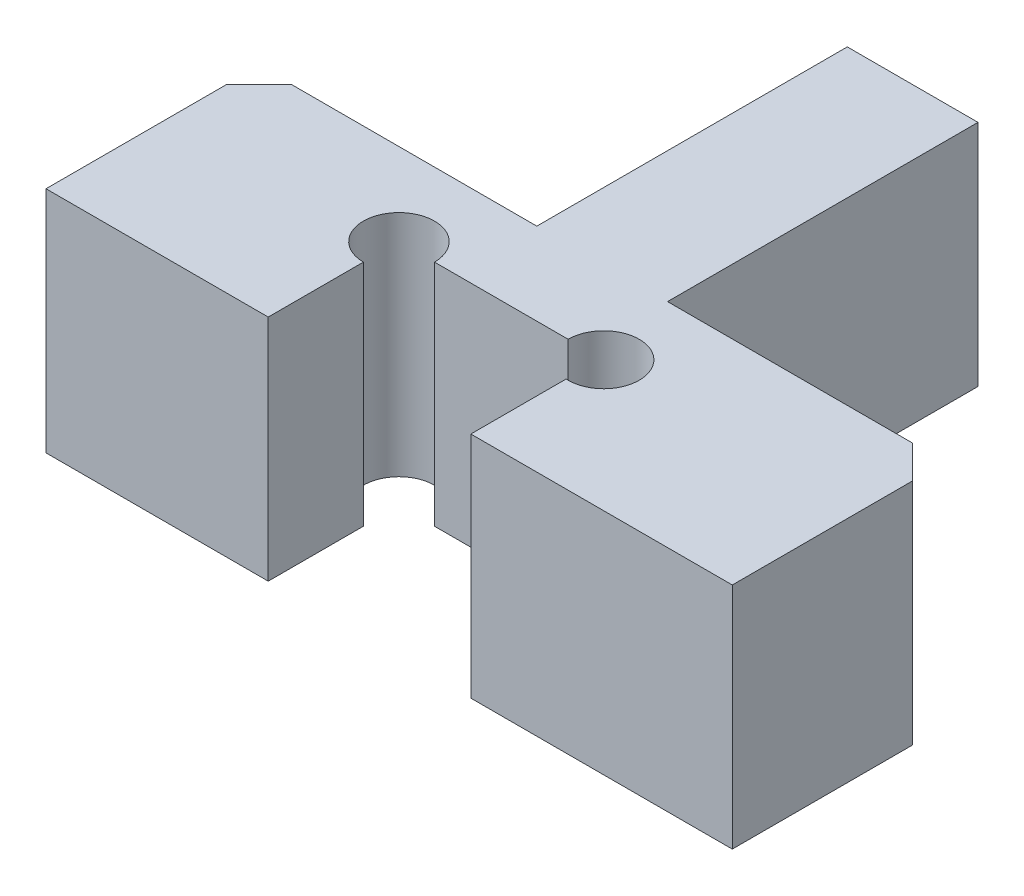
ISO-10303-21;
HEADER;
FILE_DESCRIPTION(('STEP AP214'),'2;1');
FILE_NAME('part.step','',(''),(''),'','','');
FILE_SCHEMA(('AUTOMOTIVE_DESIGN { 1 0 10303 214 1 1 1 1 }'));
ENDSEC;
DATA;
#1=APPLICATION_CONTEXT('core data for automotive mechanical design processes');
#2=APPLICATION_PROTOCOL_DEFINITION('international standard','automotive_design',2000,#1);
#3=PRODUCT_CONTEXT('',#1,'mechanical');
#4=PRODUCT('Part','Part','',(#3));
#5=PRODUCT_RELATED_PRODUCT_CATEGORY('part','',(#4));
#6=PRODUCT_DEFINITION_FORMATION('','',#4);
#7=PRODUCT_DEFINITION_CONTEXT('part definition',#1,'design');
#8=PRODUCT_DEFINITION('design','',#6,#7);
#9=PRODUCT_DEFINITION_SHAPE('','',#8);
#10=(LENGTH_UNIT() NAMED_UNIT(*) SI_UNIT(.MILLI.,.METRE.));
#11=(NAMED_UNIT(*) PLANE_ANGLE_UNIT() SI_UNIT($,.RADIAN.));
#12=(NAMED_UNIT(*) SI_UNIT($,.STERADIAN.) SOLID_ANGLE_UNIT());
#13=UNCERTAINTY_MEASURE_WITH_UNIT(LENGTH_MEASURE(1.E-05),#10,'distance_accuracy_value','');
#14=(GEOMETRIC_REPRESENTATION_CONTEXT(3) GLOBAL_UNCERTAINTY_ASSIGNED_CONTEXT((#13)) GLOBAL_UNIT_ASSIGNED_CONTEXT((#10,
#11,#12)) REPRESENTATION_CONTEXT('',''));
#15=CARTESIAN_POINT('',(0.,0.,0.));
#16=DIRECTION('',(0.,0.,1.));
#17=DIRECTION('',(1.,0.,0.));
#18=AXIS2_PLACEMENT_3D('',#15,#16,#17);
#19=CARTESIAN_POINT('',(-0.999999999999825,3.5,-7.49500456035712));
#20=DIRECTION('',(1.,0.,0.));
#21=DIRECTION('',(0.,0.,-1.));
#22=AXIS2_PLACEMENT_3D('',#19,#20,#21);
#23=PLANE('',#22);
#24=DIRECTION('',(0.,0.,1.));
#25=VECTOR('',#24,1.);
#26=CARTESIAN_POINT('',(-0.999999999999825,0.,-7.49500456035712));
#27=LINE('',#26,#25);
#28=CARTESIAN_POINT('',(-0.999999999999825,0.,-7.49500456035712));
#29=VERTEX_POINT('',#28);
#30=CARTESIAN_POINT('',(-0.999999999999824,0.,-2.74500456035711));
#31=VERTEX_POINT('',#30);
#32=EDGE_CURVE('E172',#29,#31,#27,.T.);
#33=ORIENTED_EDGE('',*,*,#32,.T.);
#34=DIRECTION('',(0.,-1.,0.));
#35=VECTOR('',#34,1.);
#36=CARTESIAN_POINT('',(-0.999999999999824,3.5,-2.74500456035711));
#37=LINE('',#36,#35);
#38=CARTESIAN_POINT('',(-0.999999999999824,3.5,-2.74500456035711));
#39=VERTEX_POINT('',#38);
#40=EDGE_CURVE('E154',#39,#31,#37,.T.);
#41=ORIENTED_EDGE('',*,*,#40,.F.);
#42=DIRECTION('',(0.,0.,1.));
#43=VECTOR('',#42,1.);
#44=CARTESIAN_POINT('',(-0.999999999999825,3.5,-7.49500456035712));
#45=LINE('',#44,#43);
#46=CARTESIAN_POINT('',(-0.999999999999825,3.5,-7.49500456035712));
#47=VERTEX_POINT('',#46);
#48=EDGE_CURVE('E160',#47,#39,#45,.T.);
#49=ORIENTED_EDGE('',*,*,#48,.F.);
#50=DIRECTION('',(0.,-1.,0.));
#51=VECTOR('',#50,1.);
#52=CARTESIAN_POINT('',(-0.999999999999825,3.5,-7.49500456035712));
#53=LINE('',#52,#51);
#54=EDGE_CURVE('E215',#47,#29,#53,.T.);
#55=ORIENTED_EDGE('',*,*,#54,.T.);
#56=EDGE_LOOP('',(#33,#41,#49,#55));
#57=FACE_BOUND('',#56,.T.);
#58=ADVANCED_FACE('F35',(#57),#23,.F.);
#59=CARTESIAN_POINT('',(-0.999999999999824,3.5,-2.74500456035711));
#60=DIRECTION('',(0.,0.,1.));
#61=DIRECTION('',(1.,0.,0.));
#62=AXIS2_PLACEMENT_3D('',#59,#60,#61);
#63=PLANE('',#62);
#64=DIRECTION('',(-1.,0.,0.));
#65=VECTOR('',#64,1.);
#66=CARTESIAN_POINT('',(-0.999999999999824,0.,-2.74500456035711));
#67=LINE('',#66,#65);
#68=CARTESIAN_POINT('',(-4.74999999999982,0.,-2.74500456035713));
#69=VERTEX_POINT('',#68);
#70=EDGE_CURVE('E285',#31,#69,#67,.T.);
#71=ORIENTED_EDGE('',*,*,#70,.T.);
#72=DIRECTION('',(0.,1.,0.));
#73=VECTOR('',#72,1.);
#74=CARTESIAN_POINT('',(-4.74999999999982,3.5,-2.74500456035713));
#75=LINE('',#74,#73);
#76=CARTESIAN_POINT('',(-4.74999999999982,3.5,-2.74500456035713));
#77=VERTEX_POINT('',#76);
#78=EDGE_CURVE('E157',#69,#77,#75,.T.);
#79=ORIENTED_EDGE('',*,*,#78,.T.);
#80=DIRECTION('',(-1.,0.,0.));
#81=VECTOR('',#80,1.);
#82=CARTESIAN_POINT('',(-0.999999999999824,3.5,-2.74500456035711));
#83=LINE('',#82,#81);
#84=EDGE_CURVE('E149',#39,#77,#83,.T.);
#85=ORIENTED_EDGE('',*,*,#84,.F.);
#86=ORIENTED_EDGE('',*,*,#40,.T.);
#87=EDGE_LOOP('',(#71,#79,#85,#86));
#88=FACE_BOUND('',#87,.T.);
#89=ADVANCED_FACE('F152',(#88),#63,.F.);
#90=CARTESIAN_POINT('',(-5.24999999999982,3.5,-2.74500456035713));
#91=DIRECTION('',(1.,0.,0.));
#92=DIRECTION('',(0.,0.,-1.));
#93=AXIS2_PLACEMENT_3D('',#90,#91,#92);
#94=PLANE('',#93);
#95=DIRECTION('',(0.,0.,1.));
#96=VECTOR('',#95,1.);
#97=CARTESIAN_POINT('',(-5.24999999999982,3.5,-2.74500456035713));
#98=LINE('',#97,#96);
#99=CARTESIAN_POINT('',(-5.24999999999982,3.5,-2.24500456035714));
#100=VERTEX_POINT('',#99);
#101=CARTESIAN_POINT('',(-5.24999999999982,3.5,0.514245439642866));
#102=VERTEX_POINT('',#101);
#103=EDGE_CURVE('E159',#100,#102,#98,.T.);
#104=ORIENTED_EDGE('',*,*,#103,.F.);
#105=DIRECTION('',(0.,-1.,0.));
#106=VECTOR('',#105,1.);
#107=CARTESIAN_POINT('',(-5.24999999999982,3.5,-2.24500456035714));
#108=LINE('',#107,#106);
#109=CARTESIAN_POINT('',(-5.24999999999982,0.,-2.24500456035714));
#110=VERTEX_POINT('',#109);
#111=EDGE_CURVE('E173',#100,#110,#108,.T.);
#112=ORIENTED_EDGE('',*,*,#111,.T.);
#113=DIRECTION('',(0.,0.,1.));
#114=VECTOR('',#113,1.);
#115=CARTESIAN_POINT('',(-5.24999999999982,0.,-2.74500456035713));
#116=LINE('',#115,#114);
#117=CARTESIAN_POINT('',(-5.24999999999982,0.,0.514245439642866));
#118=VERTEX_POINT('',#117);
#119=EDGE_CURVE('E255',#110,#118,#116,.T.);
#120=ORIENTED_EDGE('',*,*,#119,.T.);
#121=DIRECTION('',(0.,-1.,0.));
#122=VECTOR('',#121,1.);
#123=CARTESIAN_POINT('',(-5.24999999999982,3.5,0.514245439642866));
#124=LINE('',#123,#122);
#125=EDGE_CURVE('E174',#102,#118,#124,.T.);
#126=ORIENTED_EDGE('',*,*,#125,.F.);
#127=EDGE_LOOP('',(#104,#112,#120,#126));
#128=FACE_BOUND('',#127,.T.);
#129=ADVANCED_FACE('F289',(#128),#94,.F.);
#130=CARTESIAN_POINT('',(-5.24999999999982,3.5,0.514245439642866));
#131=DIRECTION('',(0.,0.,-1.));
#132=DIRECTION('',(-1.,0.,0.));
#133=AXIS2_PLACEMENT_3D('',#130,#131,#132);
#134=PLANE('',#133);
#135=DIRECTION('',(1.,0.,0.));
#136=VECTOR('',#135,1.);
#137=CARTESIAN_POINT('',(-5.24999999999982,0.,0.514245439642866));
#138=LINE('',#137,#136);
#139=CARTESIAN_POINT('',(-1.84999999999983,0.,0.514245439642866));
#140=VERTEX_POINT('',#139);
#141=EDGE_CURVE('E248',#118,#140,#138,.T.);
#142=ORIENTED_EDGE('',*,*,#141,.T.);
#143=DIRECTION('',(0.,-1.,0.));
#144=VECTOR('',#143,1.);
#145=CARTESIAN_POINT('',(-1.84999999999983,3.5,0.514245439642866));
#146=LINE('',#145,#144);
#147=CARTESIAN_POINT('',(-1.84999999999983,3.5,0.514245439642866));
#148=VERTEX_POINT('',#147);
#149=EDGE_CURVE('E180',#148,#140,#146,.T.);
#150=ORIENTED_EDGE('',*,*,#149,.F.);
#151=DIRECTION('',(1.,0.,0.));
#152=VECTOR('',#151,1.);
#153=CARTESIAN_POINT('',(-5.24999999999982,3.5,0.514245439642866));
#154=LINE('',#153,#152);
#155=EDGE_CURVE('E292',#102,#148,#154,.T.);
#156=ORIENTED_EDGE('',*,*,#155,.F.);
#157=ORIENTED_EDGE('',*,*,#125,.T.);
#158=EDGE_LOOP('',(#142,#150,#156,#157));
#159=FACE_BOUND('',#158,.T.);
#160=ADVANCED_FACE('F291',(#159),#134,.F.);
#161=CARTESIAN_POINT('',(-1.84999999999983,3.5,0.514245439642866));
#162=DIRECTION('',(-1.,0.,0.));
#163=DIRECTION('',(0.,0.,1.));
#164=AXIS2_PLACEMENT_3D('',#161,#162,#163);
#165=PLANE('',#164);
#166=DIRECTION('',(0.,0.,-1.));
#167=VECTOR('',#166,1.);
#168=CARTESIAN_POINT('',(-1.84999999999983,0.,0.514245439642866));
#169=LINE('',#168,#167);
#170=CARTESIAN_POINT('',(-1.84999999999983,0.,-0.942004128547135));
#171=VERTEX_POINT('',#170);
#172=EDGE_CURVE('E242',#140,#171,#169,.T.);
#173=ORIENTED_EDGE('',*,*,#172,.T.);
#174=DIRECTION('',(0.,-1.,0.));
#175=VECTOR('',#174,1.);
#176=CARTESIAN_POINT('',(-1.84999999999983,3.5,-0.942004128547135));
#177=LINE('',#176,#175);
#178=CARTESIAN_POINT('',(-1.84999999999983,3.5,-0.942004128547135));
#179=VERTEX_POINT('',#178);
#180=EDGE_CURVE('E233',#179,#171,#177,.T.);
#181=ORIENTED_EDGE('',*,*,#180,.F.);
#182=DIRECTION('',(0.,0.,-1.));
#183=VECTOR('',#182,1.);
#184=CARTESIAN_POINT('',(-1.84999999999983,3.5,0.514245439642866));
#185=LINE('',#184,#183);
#186=EDGE_CURVE('E244',#148,#179,#185,.T.);
#187=ORIENTED_EDGE('',*,*,#186,.F.);
#188=ORIENTED_EDGE('',*,*,#149,.T.);
#189=EDGE_LOOP('',(#173,#181,#187,#188));
#190=FACE_BOUND('',#189,.T.);
#191=ADVANCED_FACE('F240',(#190),#165,.F.);
#192=CARTESIAN_POINT('',(-1.84999999999983,3.5,-1.48575456035713));
#193=DIRECTION('',(0.,-1.,0.));
#194=DIRECTION('',(0.,0.,-1.));
#195=AXIS2_PLACEMENT_3D('',#192,#193,#194);
#196=CYLINDRICAL_SURFACE('',#195,0.543750431809999);
#197=CARTESIAN_POINT('',(-1.84999999999983,0.,-1.48575456035713));
#198=DIRECTION('',(0.,1.,0.));
#199=DIRECTION('',(0.,0.,1.));
#200=AXIS2_PLACEMENT_3D('',#197,#198,#199);
#201=CIRCLE('',#200,0.543750431809999);
#202=CARTESIAN_POINT('',(-1.30624956818984,0.,-1.48575456035713));
#203=VERTEX_POINT('',#202);
#204=EDGE_CURVE('E251',#203,#171,#201,.T.);
#205=ORIENTED_EDGE('',*,*,#204,.F.);
#206=DIRECTION('',(0.,-1.,0.));
#207=VECTOR('',#206,1.);
#208=CARTESIAN_POINT('',(-1.30624956818984,3.5,-1.48575456035713));
#209=LINE('',#208,#207);
#210=CARTESIAN_POINT('',(-1.30624956818984,3.5,-1.48575456035713));
#211=VERTEX_POINT('',#210);
#212=EDGE_CURVE('E231',#211,#203,#209,.T.);
#213=ORIENTED_EDGE('',*,*,#212,.F.);
#214=CARTESIAN_POINT('',(-1.84999999999983,3.5,-1.48575456035713));
#215=DIRECTION('',(0.,1.,0.));
#216=DIRECTION('',(0.,0.,1.));
#217=AXIS2_PLACEMENT_3D('',#214,#215,#216);
#218=CIRCLE('',#217,0.543750431809999);
#219=EDGE_CURVE('E294',#211,#179,#218,.T.);
#220=ORIENTED_EDGE('',*,*,#219,.T.);
#221=ORIENTED_EDGE('',*,*,#180,.T.);
#222=EDGE_LOOP('',(#205,#213,#220,#221));
#223=FACE_BOUND('',#222,.T.);
#224=ADVANCED_FACE('F317',(#223),#196,.F.);
#225=CARTESIAN_POINT('',(-1.30624956818984,3.5,-1.48575456035713));
#226=DIRECTION('',(0.,0.,-1.));
#227=DIRECTION('',(-1.,0.,0.));
#228=AXIS2_PLACEMENT_3D('',#225,#226,#227);
#229=PLANE('',#228);
#230=DIRECTION('',(1.,0.,0.));
#231=VECTOR('',#230,1.);
#232=CARTESIAN_POINT('',(-1.30624956818984,0.,-1.48575456035713));
#233=LINE('',#232,#231);
#234=CARTESIAN_POINT('',(0.738401898266421,0.,-1.48575456035713));
#235=VERTEX_POINT('',#234);
#236=EDGE_CURVE('E253',#203,#235,#233,.T.);
#237=ORIENTED_EDGE('',*,*,#236,.T.);
#238=DIRECTION('',(0.,-1.,0.));
#239=VECTOR('',#238,1.);
#240=CARTESIAN_POINT('',(0.738401898266421,3.5,-1.48575456035713));
#241=LINE('',#240,#239);
#242=CARTESIAN_POINT('',(0.738401898266421,3.5,-1.48575456035713));
#243=VERTEX_POINT('',#242);
#244=EDGE_CURVE('E229',#243,#235,#241,.T.);
#245=ORIENTED_EDGE('',*,*,#244,.F.);
#246=DIRECTION('',(1.,0.,0.));
#247=VECTOR('',#246,1.);
#248=CARTESIAN_POINT('',(-1.30624956818984,3.5,-1.48575456035713));
#249=LINE('',#248,#247);
#250=EDGE_CURVE('E300',#211,#243,#249,.T.);
#251=ORIENTED_EDGE('',*,*,#250,.F.);
#252=ORIENTED_EDGE('',*,*,#212,.T.);
#253=EDGE_LOOP('',(#237,#245,#251,#252));
#254=FACE_BOUND('',#253,.T.);
#255=ADVANCED_FACE('F318',(#254),#229,.F.);
#256=CARTESIAN_POINT('',(1.28215233007642,3.5,-1.48575456035713));
#257=DIRECTION('',(0.,-1.,0.));
#258=DIRECTION('',(0.,0.,-1.));
#259=AXIS2_PLACEMENT_3D('',#256,#257,#258);
#260=CYLINDRICAL_SURFACE('',#259,0.543750431809999);
#261=CARTESIAN_POINT('',(1.28215233007642,0.,-1.48575456035713));
#262=DIRECTION('',(0.,1.,0.));
#263=DIRECTION('',(0.,0.,1.));
#264=AXIS2_PLACEMENT_3D('',#261,#262,#263);
#265=CIRCLE('',#264,0.543750431809999);
#266=CARTESIAN_POINT('',(1.25000000000018,0.,-0.942955555416789));
#267=VERTEX_POINT('',#266);
#268=EDGE_CURVE('E261',#267,#235,#265,.T.);
#269=ORIENTED_EDGE('',*,*,#268,.F.);
#270=DIRECTION('',(0.,-1.,0.));
#271=VECTOR('',#270,1.);
#272=CARTESIAN_POINT('',(1.25000000000018,3.5,-0.942955555416789));
#273=LINE('',#272,#271);
#274=CARTESIAN_POINT('',(1.25000000000018,3.5,-0.942955555416789));
#275=VERTEX_POINT('',#274);
#276=EDGE_CURVE('E227',#275,#267,#273,.T.);
#277=ORIENTED_EDGE('',*,*,#276,.F.);
#278=CARTESIAN_POINT('',(1.28215233007642,3.5,-1.48575456035713));
#279=DIRECTION('',(0.,1.,0.));
#280=DIRECTION('',(0.,0.,1.));
#281=AXIS2_PLACEMENT_3D('',#278,#279,#280);
#282=CIRCLE('',#281,0.543750431809999);
#283=EDGE_CURVE('E302',#275,#243,#282,.T.);
#284=ORIENTED_EDGE('',*,*,#283,.T.);
#285=ORIENTED_EDGE('',*,*,#244,.T.);
#286=EDGE_LOOP('',(#269,#277,#284,#285));
#287=FACE_BOUND('',#286,.T.);
#288=ADVANCED_FACE('F314',(#287),#260,.F.);
#289=CARTESIAN_POINT('',(1.25000000000018,3.5,0.514245439642866));
#290=DIRECTION('',(-1.,0.,0.));
#291=DIRECTION('',(0.,0.,1.));
#292=AXIS2_PLACEMENT_3D('',#289,#290,#291);
#293=PLANE('',#292);
#294=DIRECTION('',(0.,0.,-1.));
#295=VECTOR('',#294,1.);
#296=CARTESIAN_POINT('',(1.25000000000018,0.,0.514245439642866));
#297=LINE('',#296,#295);
#298=CARTESIAN_POINT('',(1.25000000000018,0.,0.514245439642866));
#299=VERTEX_POINT('',#298);
#300=EDGE_CURVE('E264',#299,#267,#297,.T.);
#301=ORIENTED_EDGE('',*,*,#300,.F.);
#302=DIRECTION('',(0.,-1.,0.));
#303=VECTOR('',#302,1.);
#304=CARTESIAN_POINT('',(1.25000000000018,3.5,0.514245439642866));
#305=LINE('',#304,#303);
#306=CARTESIAN_POINT('',(1.25000000000018,3.5,0.514245439642866));
#307=VERTEX_POINT('',#306);
#308=EDGE_CURVE('E225',#307,#299,#305,.T.);
#309=ORIENTED_EDGE('',*,*,#308,.F.);
#310=DIRECTION('',(0.,0.,-1.));
#311=VECTOR('',#310,1.);
#312=CARTESIAN_POINT('',(1.25000000000018,3.5,0.514245439642866));
#313=LINE('',#312,#311);
#314=EDGE_CURVE('E278',#307,#275,#313,.T.);
#315=ORIENTED_EDGE('',*,*,#314,.T.);
#316=ORIENTED_EDGE('',*,*,#276,.T.);
#317=EDGE_LOOP('',(#301,#309,#315,#316));
#318=FACE_BOUND('',#317,.T.);
#319=ADVANCED_FACE('F307',(#318),#293,.T.);
#320=CARTESIAN_POINT('',(1.25000000000018,3.5,0.514245439642866));
#321=DIRECTION('',(0.,0.,-1.));
#322=DIRECTION('',(-1.,0.,0.));
#323=AXIS2_PLACEMENT_3D('',#320,#321,#322);
#324=PLANE('',#323);
#325=DIRECTION('',(1.,0.,0.));
#326=VECTOR('',#325,1.);
#327=CARTESIAN_POINT('',(1.25000000000018,0.,0.514245439642866));
#328=LINE('',#327,#326);
#329=CARTESIAN_POINT('',(5.24999999999982,0.,0.514245439642866));
#330=VERTEX_POINT('',#329);
#331=EDGE_CURVE('E210',#299,#330,#328,.T.);
#332=ORIENTED_EDGE('',*,*,#331,.T.);
#333=DIRECTION('',(0.,-1.,0.));
#334=VECTOR('',#333,1.);
#335=CARTESIAN_POINT('',(5.24999999999982,3.5,0.514245439642866));
#336=LINE('',#335,#334);
#337=CARTESIAN_POINT('',(5.24999999999982,3.5,0.514245439642866));
#338=VERTEX_POINT('',#337);
#339=EDGE_CURVE('E222',#338,#330,#336,.T.);
#340=ORIENTED_EDGE('',*,*,#339,.F.);
#341=DIRECTION('',(1.,0.,0.));
#342=VECTOR('',#341,1.);
#343=CARTESIAN_POINT('',(1.25000000000018,3.5,0.514245439642866));
#344=LINE('',#343,#342);
#345=EDGE_CURVE('E274',#307,#338,#344,.T.);
#346=ORIENTED_EDGE('',*,*,#345,.F.);
#347=ORIENTED_EDGE('',*,*,#308,.T.);
#348=EDGE_LOOP('',(#332,#340,#346,#347));
#349=FACE_BOUND('',#348,.T.);
#350=ADVANCED_FACE('F269',(#349),#324,.F.);
#351=CARTESIAN_POINT('',(5.24999999999982,3.5,0.514245439642866));
#352=DIRECTION('',(-1.,0.,0.));
#353=DIRECTION('',(0.,0.,1.));
#354=AXIS2_PLACEMENT_3D('',#351,#352,#353);
#355=PLANE('',#354);
#356=DIRECTION('',(0.,0.,-1.));
#357=VECTOR('',#356,1.);
#358=CARTESIAN_POINT('',(5.24999999999982,0.,0.514245439642866));
#359=LINE('',#358,#357);
#360=CARTESIAN_POINT('',(5.24999999999982,0.,-2.24500456035713));
#361=VERTEX_POINT('',#360);
#362=EDGE_CURVE('E207',#330,#361,#359,.T.);
#363=ORIENTED_EDGE('',*,*,#362,.T.);
#364=DIRECTION('',(0.,1.,0.));
#365=VECTOR('',#364,1.);
#366=CARTESIAN_POINT('',(5.24999999999982,3.5,-2.24500456035713));
#367=LINE('',#366,#365);
#368=CARTESIAN_POINT('',(5.24999999999982,3.5,-2.24500456035713));
#369=VERTEX_POINT('',#368);
#370=EDGE_CURVE('E11',#361,#369,#367,.T.);
#371=ORIENTED_EDGE('',*,*,#370,.T.);
#372=DIRECTION('',(0.,0.,-1.));
#373=VECTOR('',#372,1.);
#374=CARTESIAN_POINT('',(5.24999999999982,3.5,0.514245439642866));
#375=LINE('',#374,#373);
#376=EDGE_CURVE('E273',#338,#369,#375,.T.);
#377=ORIENTED_EDGE('',*,*,#376,.F.);
#378=ORIENTED_EDGE('',*,*,#339,.T.);
#379=EDGE_LOOP('',(#363,#371,#377,#378));
#380=FACE_BOUND('',#379,.T.);
#381=ADVANCED_FACE('F272',(#380),#355,.F.);
#382=CARTESIAN_POINT('',(5.24999999999982,3.5,-2.74500456035713));
#383=DIRECTION('',(0.,0.,1.));
#384=DIRECTION('',(1.,0.,0.));
#385=AXIS2_PLACEMENT_3D('',#382,#383,#384);
#386=PLANE('',#385);
#387=DIRECTION('',(-1.,0.,0.));
#388=VECTOR('',#387,1.);
#389=CARTESIAN_POINT('',(5.24999999999982,3.5,-2.74500456035713));
#390=LINE('',#389,#388);
#391=CARTESIAN_POINT('',(4.74999999999983,3.5,-2.74500456035713));
#392=VERTEX_POINT('',#391);
#393=CARTESIAN_POINT('',(0.999999999999824,3.5,-2.74500456035711));
#394=VERTEX_POINT('',#393);
#395=EDGE_CURVE('E198',#392,#394,#390,.T.);
#396=ORIENTED_EDGE('',*,*,#395,.F.);
#397=DIRECTION('',(0.,-1.,0.));
#398=VECTOR('',#397,1.);
#399=CARTESIAN_POINT('',(4.74999999999983,3.5,-2.74500456035713));
#400=LINE('',#399,#398);
#401=CARTESIAN_POINT('',(4.74999999999983,0.,-2.74500456035713));
#402=VERTEX_POINT('',#401);
#403=EDGE_CURVE('E44',#392,#402,#400,.T.);
#404=ORIENTED_EDGE('',*,*,#403,.T.);
#405=DIRECTION('',(-1.,0.,0.));
#406=VECTOR('',#405,1.);
#407=CARTESIAN_POINT('',(5.24999999999982,0.,-2.74500456035713));
#408=LINE('',#407,#406);
#409=CARTESIAN_POINT('',(0.999999999999824,0.,-2.74500456035711));
#410=VERTEX_POINT('',#409);
#411=EDGE_CURVE('E196',#402,#410,#408,.T.);
#412=ORIENTED_EDGE('',*,*,#411,.T.);
#413=DIRECTION('',(0.,-1.,0.));
#414=VECTOR('',#413,1.);
#415=CARTESIAN_POINT('',(0.999999999999824,3.5,-2.74500456035711));
#416=LINE('',#415,#414);
#417=EDGE_CURVE('E220',#394,#410,#416,.T.);
#418=ORIENTED_EDGE('',*,*,#417,.F.);
#419=EDGE_LOOP('',(#396,#404,#412,#418));
#420=FACE_BOUND('',#419,.T.);
#421=ADVANCED_FACE('F194',(#420),#386,.F.);
#422=CARTESIAN_POINT('',(0.999999999999824,3.5,-2.74500456035711));
#423=DIRECTION('',(-1.,0.,0.));
#424=DIRECTION('',(0.,0.,1.));
#425=AXIS2_PLACEMENT_3D('',#422,#423,#424);
#426=PLANE('',#425);
#427=DIRECTION('',(0.,0.,-1.));
#428=VECTOR('',#427,1.);
#429=CARTESIAN_POINT('',(0.999999999999824,0.,-2.74500456035711));
#430=LINE('',#429,#428);
#431=CARTESIAN_POINT('',(0.999999999999825,0.,-7.49500456035712));
#432=VERTEX_POINT('',#431);
#433=EDGE_CURVE('E206',#410,#432,#430,.T.);
#434=ORIENTED_EDGE('',*,*,#433,.T.);
#435=DIRECTION('',(0.,-1.,0.));
#436=VECTOR('',#435,1.);
#437=CARTESIAN_POINT('',(0.999999999999825,3.5,-7.49500456035712));
#438=LINE('',#437,#436);
#439=CARTESIAN_POINT('',(0.999999999999825,3.5,-7.49500456035712));
#440=VERTEX_POINT('',#439);
#441=EDGE_CURVE('E217',#440,#432,#438,.T.);
#442=ORIENTED_EDGE('',*,*,#441,.F.);
#443=DIRECTION('',(0.,0.,-1.));
#444=VECTOR('',#443,1.);
#445=CARTESIAN_POINT('',(0.999999999999824,3.5,-2.74500456035711));
#446=LINE('',#445,#444);
#447=EDGE_CURVE('E276',#394,#440,#446,.T.);
#448=ORIENTED_EDGE('',*,*,#447,.F.);
#449=ORIENTED_EDGE('',*,*,#417,.T.);
#450=EDGE_LOOP('',(#434,#442,#448,#449));
#451=FACE_BOUND('',#450,.T.);
#452=ADVANCED_FACE('F350',(#451),#426,.F.);
#453=CARTESIAN_POINT('',(0.999999999999825,3.5,-7.49500456035712));
#454=DIRECTION('',(0.,0.,1.));
#455=DIRECTION('',(1.,0.,0.));
#456=AXIS2_PLACEMENT_3D('',#453,#454,#455);
#457=PLANE('',#456);
#458=DIRECTION('',(-1.,0.,0.));
#459=VECTOR('',#458,1.);
#460=CARTESIAN_POINT('',(0.999999999999825,0.,-7.49500456035712));
#461=LINE('',#460,#459);
#462=EDGE_CURVE('E169',#432,#29,#461,.T.);
#463=ORIENTED_EDGE('',*,*,#462,.T.);
#464=ORIENTED_EDGE('',*,*,#54,.F.);
#465=DIRECTION('',(-1.,0.,0.));
#466=VECTOR('',#465,1.);
#467=CARTESIAN_POINT('',(0.999999999999825,3.5,-7.49500456035712));
#468=LINE('',#467,#466);
#469=EDGE_CURVE('E165',#440,#47,#468,.T.);
#470=ORIENTED_EDGE('',*,*,#469,.F.);
#471=ORIENTED_EDGE('',*,*,#441,.T.);
#472=EDGE_LOOP('',(#463,#464,#470,#471));
#473=FACE_BOUND('',#472,.T.);
#474=ADVANCED_FACE('F346',(#473),#457,.F.);
#475=CARTESIAN_POINT('',(-1.84999999999983,3.5,-1.48575456035713));
#476=DIRECTION('',(0.,1.,0.));
#477=DIRECTION('',(0.,0.,1.));
#478=AXIS2_PLACEMENT_3D('',#475,#476,#477);
#479=PLANE('',#478);
#480=ORIENTED_EDGE('',*,*,#84,.T.);
#481=DIRECTION('',(0.707106781186552,0.,-0.707106781186543));
#482=VECTOR('',#481,1.);
#483=CARTESIAN_POINT('',(-3.92962499999981,3.5,-3.56537956035714));
#484=LINE('',#483,#482);
#485=EDGE_CURVE('E189',#77,#100,#484,.F.);
#486=ORIENTED_EDGE('',*,*,#485,.T.);
#487=ORIENTED_EDGE('',*,*,#103,.T.);
#488=ORIENTED_EDGE('',*,*,#155,.T.);
#489=ORIENTED_EDGE('',*,*,#186,.T.);
#490=ORIENTED_EDGE('',*,*,#219,.F.);
#491=ORIENTED_EDGE('',*,*,#250,.T.);
#492=ORIENTED_EDGE('',*,*,#283,.F.);
#493=ORIENTED_EDGE('',*,*,#314,.F.);
#494=ORIENTED_EDGE('',*,*,#345,.T.);
#495=ORIENTED_EDGE('',*,*,#376,.T.);
#496=DIRECTION('',(0.707106781186546,0.,0.707106781186549));
#497=VECTOR('',#496,1.);
#498=CARTESIAN_POINT('',(2.07962500000001,3.5,-5.41537956035696));
#499=LINE('',#498,#497);
#500=EDGE_CURVE('E51',#369,#392,#499,.F.);
#501=ORIENTED_EDGE('',*,*,#500,.T.);
#502=ORIENTED_EDGE('',*,*,#395,.T.);
#503=ORIENTED_EDGE('',*,*,#447,.T.);
#504=ORIENTED_EDGE('',*,*,#469,.T.);
#505=ORIENTED_EDGE('',*,*,#48,.T.);
#506=EDGE_LOOP('',(#480,#486,#487,#488,#489,#490,#491,#492,#493,#494,#495,#501,#502,#503,#504,#505));
#507=FACE_BOUND('',#506,.T.);
#508=ADVANCED_FACE('F163',(#507),#479,.T.);
#509=CARTESIAN_POINT('',(-1.84999999999983,0.,-1.48575456035713));
#510=DIRECTION('',(0.,1.,0.));
#511=DIRECTION('',(0.,0.,1.));
#512=AXIS2_PLACEMENT_3D('',#509,#510,#511);
#513=PLANE('',#512);
#514=ORIENTED_EDGE('',*,*,#119,.F.);
#515=DIRECTION('',(-0.707106781186552,0.,0.707106781186543));
#516=VECTOR('',#515,1.);
#517=CARTESIAN_POINT('',(-5.24999999999982,0.,-2.24500456035714));
#518=LINE('',#517,#516);
#519=EDGE_CURVE('E185',#110,#69,#518,.F.);
#520=ORIENTED_EDGE('',*,*,#519,.T.);
#521=ORIENTED_EDGE('',*,*,#70,.F.);
#522=ORIENTED_EDGE('',*,*,#32,.F.);
#523=ORIENTED_EDGE('',*,*,#462,.F.);
#524=ORIENTED_EDGE('',*,*,#433,.F.);
#525=ORIENTED_EDGE('',*,*,#411,.F.);
#526=DIRECTION('',(-0.707106781186546,0.,-0.707106781186549));
#527=VECTOR('',#526,1.);
#528=CARTESIAN_POINT('',(4.74999999999983,0.,-2.74500456035713));
#529=LINE('',#528,#527);
#530=EDGE_CURVE('E177',#402,#361,#529,.F.);
#531=ORIENTED_EDGE('',*,*,#530,.T.);
#532=ORIENTED_EDGE('',*,*,#362,.F.);
#533=ORIENTED_EDGE('',*,*,#331,.F.);
#534=ORIENTED_EDGE('',*,*,#300,.T.);
#535=ORIENTED_EDGE('',*,*,#268,.T.);
#536=ORIENTED_EDGE('',*,*,#236,.F.);
#537=ORIENTED_EDGE('',*,*,#204,.T.);
#538=ORIENTED_EDGE('',*,*,#172,.F.);
#539=ORIENTED_EDGE('',*,*,#141,.F.);
#540=EDGE_LOOP('',(#514,#520,#521,#522,#523,#524,#525,#531,#532,#533,#534,#535,#536,#537,#538,#539));
#541=FACE_BOUND('',#540,.T.);
#542=ADVANCED_FACE('F203',(#541),#513,.F.);
#543=CARTESIAN_POINT('',(-5.24999999999982,3.5,-2.24500456035714));
#544=DIRECTION('',(0.707106781186543,0.,0.707106781186552));
#545=DIRECTION('',(0.,-1.,0.));
#546=AXIS2_PLACEMENT_3D('',#543,#544,#545);
#547=PLANE('',#546);
#548=ORIENTED_EDGE('',*,*,#485,.F.);
#549=ORIENTED_EDGE('',*,*,#78,.F.);
#550=ORIENTED_EDGE('',*,*,#519,.F.);
#551=ORIENTED_EDGE('',*,*,#111,.F.);
#552=EDGE_LOOP('',(#548,#549,#550,#551));
#553=FACE_BOUND('',#552,.T.);
#554=ADVANCED_FACE('F335',(#553),#547,.F.);
#555=CARTESIAN_POINT('',(4.74999999999983,3.5,-2.74500456035713));
#556=DIRECTION('',(-0.707106781186549,0.,0.707106781186546));
#557=DIRECTION('',(0.,-1.,0.));
#558=AXIS2_PLACEMENT_3D('',#555,#556,#557);
#559=PLANE('',#558);
#560=ORIENTED_EDGE('',*,*,#500,.F.);
#561=ORIENTED_EDGE('',*,*,#370,.F.);
#562=ORIENTED_EDGE('',*,*,#530,.F.);
#563=ORIENTED_EDGE('',*,*,#403,.F.);
#564=EDGE_LOOP('',(#560,#561,#562,#563));
#565=FACE_BOUND('',#564,.T.);
#566=ADVANCED_FACE('F38',(#565),#559,.F.);
#567=CLOSED_SHELL('',(#58,#89,#129,#160,#191,#224,#255,#288,#319,#350,#381,#421,#452,#474,#508,
#542,#554,#566));
#568=MANIFOLD_SOLID_BREP('B2',#567);
#569=ADVANCED_BREP_SHAPE_REPRESENTATION('',(#18,#568),#14);
#570=SHAPE_DEFINITION_REPRESENTATION(#9,#569);
ENDSEC;
END-ISO-10303-21;
